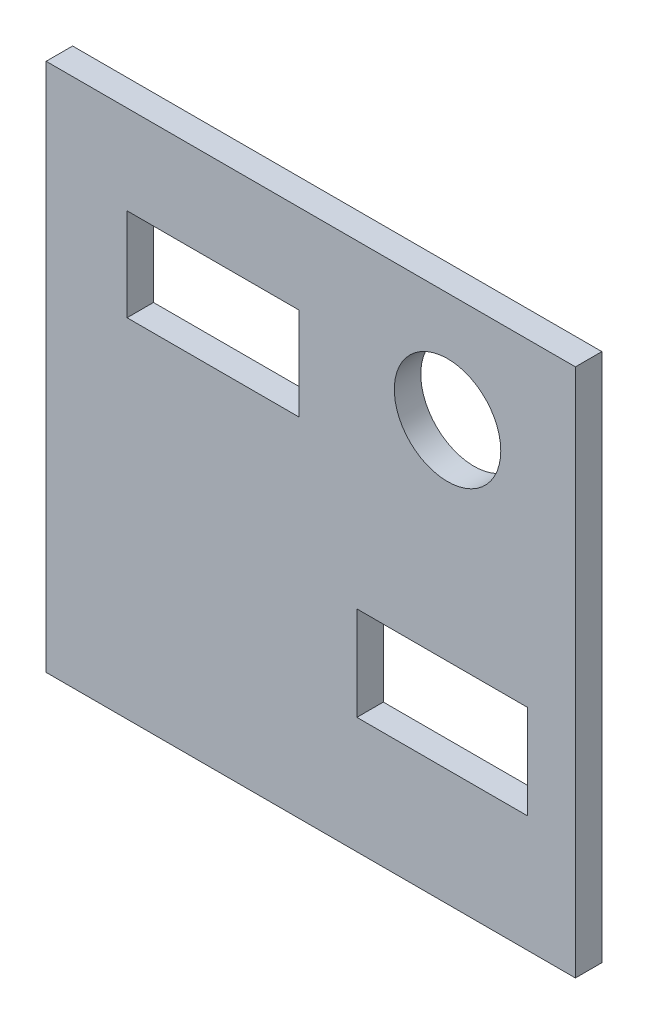
ISO-10303-21;
HEADER;
FILE_DESCRIPTION(('STEP AP214'),'2;1');
FILE_NAME('part.step','',(''),(''),'','','');
FILE_SCHEMA(('AUTOMOTIVE_DESIGN { 1 0 10303 214 1 1 1 1 }'));
ENDSEC;
DATA;
#1=APPLICATION_CONTEXT('core data for automotive mechanical design processes');
#2=APPLICATION_PROTOCOL_DEFINITION('international standard','automotive_design',2000,#1);
#3=PRODUCT_CONTEXT('',#1,'mechanical');
#4=PRODUCT('Part','Part','',(#3));
#5=PRODUCT_RELATED_PRODUCT_CATEGORY('part','',(#4));
#6=PRODUCT_DEFINITION_FORMATION('','',#4);
#7=PRODUCT_DEFINITION_CONTEXT('part definition',#1,'design');
#8=PRODUCT_DEFINITION('design','',#6,#7);
#9=PRODUCT_DEFINITION_SHAPE('','',#8);
#10=(LENGTH_UNIT() NAMED_UNIT(*) SI_UNIT(.MILLI.,.METRE.));
#11=(NAMED_UNIT(*) PLANE_ANGLE_UNIT() SI_UNIT($,.RADIAN.));
#12=(NAMED_UNIT(*) SI_UNIT($,.STERADIAN.) SOLID_ANGLE_UNIT());
#13=UNCERTAINTY_MEASURE_WITH_UNIT(LENGTH_MEASURE(1.E-05),#10,'distance_accuracy_value','');
#14=(GEOMETRIC_REPRESENTATION_CONTEXT(3) GLOBAL_UNCERTAINTY_ASSIGNED_CONTEXT((#13)) GLOBAL_UNIT_ASSIGNED_CONTEXT((#10,
#11,#12)) REPRESENTATION_CONTEXT('',''));
#15=CARTESIAN_POINT('',(0.,0.,0.));
#16=DIRECTION('',(0.,0.,1.));
#17=DIRECTION('',(1.,0.,0.));
#18=AXIS2_PLACEMENT_3D('',#15,#16,#17);
#19=CARTESIAN_POINT('',(0.,0.,2.));
#20=DIRECTION('',(0.,0.,1.));
#21=DIRECTION('',(1.,0.,0.));
#22=AXIS2_PLACEMENT_3D('',#19,#20,#21);
#23=PLANE('',#22);
#24=DIRECTION('',(0.,-1.,0.));
#25=VECTOR('',#24,1.);
#26=CARTESIAN_POINT('',(-17.9816513761468,13.6391437308868,2.));
#27=LINE('',#26,#25);
#28=CARTESIAN_POINT('',(-17.9816513761468,13.6391437308868,2.));
#29=VERTEX_POINT('',#28);
#30=CARTESIAN_POINT('',(-17.9816513761468,-26.3608562691132,2.));
#31=VERTEX_POINT('',#30);
#32=EDGE_CURVE('E195',#29,#31,#27,.T.);
#33=ORIENTED_EDGE('',*,*,#32,.T.);
#34=DIRECTION('',(1.,0.,0.));
#35=VECTOR('',#34,1.);
#36=CARTESIAN_POINT('',(-17.9816513761468,-26.3608562691132,2.));
#37=LINE('',#36,#35);
#38=CARTESIAN_POINT('',(22.0183486238532,-26.3608562691132,2.));
#39=VERTEX_POINT('',#38);
#40=EDGE_CURVE('E198',#31,#39,#37,.T.);
#41=ORIENTED_EDGE('',*,*,#40,.T.);
#42=DIRECTION('',(0.,1.,0.));
#43=VECTOR('',#42,1.);
#44=CARTESIAN_POINT('',(22.0183486238532,13.6391437308868,2.));
#45=LINE('',#44,#43);
#46=CARTESIAN_POINT('',(22.0183486238532,13.6391437308868,2.));
#47=VERTEX_POINT('',#46);
#48=EDGE_CURVE('E201',#39,#47,#45,.T.);
#49=ORIENTED_EDGE('',*,*,#48,.T.);
#50=DIRECTION('',(-1.,0.,0.));
#51=VECTOR('',#50,1.);
#52=CARTESIAN_POINT('',(-17.9816513761468,13.6391437308868,2.));
#53=LINE('',#52,#51);
#54=EDGE_CURVE('E203',#47,#29,#53,.T.);
#55=ORIENTED_EDGE('',*,*,#54,.T.);
#56=EDGE_LOOP('',(#33,#41,#49,#55));
#57=FACE_BOUND('',#56,.T.);
#58=CARTESIAN_POINT('',(12.3547400611621,5.3211009174312,2.));
#59=DIRECTION('',(0.,0.,1.));
#60=DIRECTION('',(1.,0.,0.));
#61=AXIS2_PLACEMENT_3D('',#58,#59,#60);
#62=CIRCLE('',#61,4.02370255740637);
#63=CARTESIAN_POINT('',(16.3784426185684,5.3211009174312,2.));
#64=VERTEX_POINT('',#63);
#65=EDGE_CURVE('E189',#64,#64,#62,.T.);
#66=ORIENTED_EDGE('',*,*,#65,.F.);
#67=EDGE_LOOP('',(#66));
#68=FACE_BOUND('',#67,.T.);
#69=DIRECTION('',(1.,0.,0.));
#70=VECTOR('',#69,1.);
#71=CARTESIAN_POINT('',(-11.8654434250764,-0.0886850152905178,2.));
#72=LINE('',#71,#70);
#73=CARTESIAN_POINT('',(-11.8654434250764,-0.0886850152905178,2.));
#74=VERTEX_POINT('',#73);
#75=CARTESIAN_POINT('',(1.13455657492355,-0.0886850152905178,2.));
#76=VERTEX_POINT('',#75);
#77=EDGE_CURVE('E160',#74,#76,#72,.T.);
#78=ORIENTED_EDGE('',*,*,#77,.F.);
#79=DIRECTION('',(0.,-1.,0.));
#80=VECTOR('',#79,1.);
#81=CARTESIAN_POINT('',(-11.8654434250764,6.91131498470948,2.));
#82=LINE('',#81,#80);
#83=CARTESIAN_POINT('',(-11.8654434250764,6.91131498470948,2.));
#84=VERTEX_POINT('',#83);
#85=EDGE_CURVE('E158',#84,#74,#82,.T.);
#86=ORIENTED_EDGE('',*,*,#85,.F.);
#87=DIRECTION('',(-1.,0.,0.));
#88=VECTOR('',#87,1.);
#89=CARTESIAN_POINT('',(-11.8654434250764,6.91131498470948,2.));
#90=LINE('',#89,#88);
#91=CARTESIAN_POINT('',(1.13455657492355,6.91131498470948,2.));
#92=VERTEX_POINT('',#91);
#93=EDGE_CURVE('E166',#92,#84,#90,.T.);
#94=ORIENTED_EDGE('',*,*,#93,.F.);
#95=DIRECTION('',(0.,1.,0.));
#96=VECTOR('',#95,1.);
#97=CARTESIAN_POINT('',(1.13455657492355,6.91131498470948,2.));
#98=LINE('',#97,#96);
#99=EDGE_CURVE('E163',#76,#92,#98,.T.);
#100=ORIENTED_EDGE('',*,*,#99,.F.);
#101=EDGE_LOOP('',(#78,#86,#94,#100));
#102=FACE_BOUND('',#101,.T.);
#103=DIRECTION('',(1.,0.,0.));
#104=VECTOR('',#103,1.);
#105=CARTESIAN_POINT('',(5.5045871559633,-17.5587155963303,2.));
#106=LINE('',#105,#104);
#107=CARTESIAN_POINT('',(5.5045871559633,-17.5587155963303,2.));
#108=VERTEX_POINT('',#107);
#109=CARTESIAN_POINT('',(18.4045871559633,-17.5587155963303,2.));
#110=VERTEX_POINT('',#109);
#111=EDGE_CURVE('E130',#108,#110,#106,.T.);
#112=ORIENTED_EDGE('',*,*,#111,.F.);
#113=DIRECTION('',(0.,-1.,0.));
#114=VECTOR('',#113,1.);
#115=CARTESIAN_POINT('',(5.5045871559633,-10.4587155963303,2.));
#116=LINE('',#115,#114);
#117=CARTESIAN_POINT('',(5.5045871559633,-10.4587155963303,2.));
#118=VERTEX_POINT('',#117);
#119=EDGE_CURVE('E122',#118,#108,#116,.T.);
#120=ORIENTED_EDGE('',*,*,#119,.F.);
#121=DIRECTION('',(-1.,0.,0.));
#122=VECTOR('',#121,1.);
#123=CARTESIAN_POINT('',(5.5045871559633,-10.4587155963303,2.));
#124=LINE('',#123,#122);
#125=CARTESIAN_POINT('',(18.4045871559633,-10.4587155963303,2.));
#126=VERTEX_POINT('',#125);
#127=EDGE_CURVE('E144',#126,#118,#124,.T.);
#128=ORIENTED_EDGE('',*,*,#127,.F.);
#129=DIRECTION('',(0.,1.,0.));
#130=VECTOR('',#129,1.);
#131=CARTESIAN_POINT('',(18.4045871559633,-10.4587155963303,2.));
#132=LINE('',#131,#130);
#133=EDGE_CURVE('E142',#110,#126,#132,.T.);
#134=ORIENTED_EDGE('',*,*,#133,.F.);
#135=EDGE_LOOP('',(#112,#120,#128,#134));
#136=FACE_BOUND('',#135,.T.);
#137=ADVANCED_FACE('F33',(#57,#68,#102,#136),#23,.T.);
#138=CARTESIAN_POINT('',(0.,0.,0.));
#139=DIRECTION('',(0.,0.,1.));
#140=DIRECTION('',(1.,0.,0.));
#141=AXIS2_PLACEMENT_3D('',#138,#139,#140);
#142=PLANE('',#141);
#143=DIRECTION('',(0.,-1.,0.));
#144=VECTOR('',#143,1.);
#145=CARTESIAN_POINT('',(-11.8654434250764,6.91131498470948,0.));
#146=LINE('',#145,#144);
#147=CARTESIAN_POINT('',(-11.8654434250764,6.91131498470948,0.));
#148=VERTEX_POINT('',#147);
#149=CARTESIAN_POINT('',(-11.8654434250764,-0.0886850152905178,0.));
#150=VERTEX_POINT('',#149);
#151=EDGE_CURVE('E138',#148,#150,#146,.T.);
#152=ORIENTED_EDGE('',*,*,#151,.T.);
#153=DIRECTION('',(1.,0.,0.));
#154=VECTOR('',#153,1.);
#155=CARTESIAN_POINT('',(-11.8654434250764,-0.0886850152905178,0.));
#156=LINE('',#155,#154);
#157=CARTESIAN_POINT('',(1.13455657492355,-0.0886850152905178,0.));
#158=VERTEX_POINT('',#157);
#159=EDGE_CURVE('E171',#150,#158,#156,.T.);
#160=ORIENTED_EDGE('',*,*,#159,.T.);
#161=DIRECTION('',(0.,1.,0.));
#162=VECTOR('',#161,1.);
#163=CARTESIAN_POINT('',(1.13455657492355,6.91131498470948,0.));
#164=LINE('',#163,#162);
#165=CARTESIAN_POINT('',(1.13455657492355,6.91131498470948,0.));
#166=VERTEX_POINT('',#165);
#167=EDGE_CURVE('E174',#158,#166,#164,.T.);
#168=ORIENTED_EDGE('',*,*,#167,.T.);
#169=DIRECTION('',(-1.,0.,0.));
#170=VECTOR('',#169,1.);
#171=CARTESIAN_POINT('',(-11.8654434250764,6.91131498470948,0.));
#172=LINE('',#171,#170);
#173=EDGE_CURVE('E161',#166,#148,#172,.T.);
#174=ORIENTED_EDGE('',*,*,#173,.T.);
#175=EDGE_LOOP('',(#152,#160,#168,#174));
#176=FACE_BOUND('',#175,.T.);
#177=DIRECTION('',(0.,-1.,0.));
#178=VECTOR('',#177,1.);
#179=CARTESIAN_POINT('',(-17.9816513761468,13.6391437308868,0.));
#180=LINE('',#179,#178);
#181=CARTESIAN_POINT('',(-17.9816513761468,13.6391437308868,0.));
#182=VERTEX_POINT('',#181);
#183=CARTESIAN_POINT('',(-17.9816513761468,-26.3608562691132,0.));
#184=VERTEX_POINT('',#183);
#185=EDGE_CURVE('E192',#182,#184,#180,.T.);
#186=ORIENTED_EDGE('',*,*,#185,.F.);
#187=DIRECTION('',(-1.,0.,0.));
#188=VECTOR('',#187,1.);
#189=CARTESIAN_POINT('',(-17.9816513761468,13.6391437308868,0.));
#190=LINE('',#189,#188);
#191=CARTESIAN_POINT('',(22.0183486238532,13.6391437308868,0.));
#192=VERTEX_POINT('',#191);
#193=EDGE_CURVE('E199',#192,#182,#190,.T.);
#194=ORIENTED_EDGE('',*,*,#193,.F.);
#195=DIRECTION('',(0.,1.,0.));
#196=VECTOR('',#195,1.);
#197=CARTESIAN_POINT('',(22.0183486238532,13.6391437308868,0.));
#198=LINE('',#197,#196);
#199=CARTESIAN_POINT('',(22.0183486238532,-26.3608562691132,0.));
#200=VERTEX_POINT('',#199);
#201=EDGE_CURVE('E210',#200,#192,#198,.T.);
#202=ORIENTED_EDGE('',*,*,#201,.F.);
#203=DIRECTION('',(1.,0.,0.));
#204=VECTOR('',#203,1.);
#205=CARTESIAN_POINT('',(-17.9816513761468,-26.3608562691132,0.));
#206=LINE('',#205,#204);
#207=EDGE_CURVE('E208',#184,#200,#206,.T.);
#208=ORIENTED_EDGE('',*,*,#207,.F.);
#209=EDGE_LOOP('',(#186,#194,#202,#208));
#210=FACE_BOUND('',#209,.T.);
#211=CARTESIAN_POINT('',(12.3547400611621,5.3211009174312,0.));
#212=DIRECTION('',(0.,0.,1.));
#213=DIRECTION('',(1.,0.,0.));
#214=AXIS2_PLACEMENT_3D('',#211,#212,#213);
#215=CIRCLE('',#214,4.02370255740637);
#216=CARTESIAN_POINT('',(16.3784426185684,5.3211009174312,0.));
#217=VERTEX_POINT('',#216);
#218=EDGE_CURVE('E188',#217,#217,#215,.T.);
#219=ORIENTED_EDGE('',*,*,#218,.T.);
#220=EDGE_LOOP('',(#219));
#221=FACE_BOUND('',#220,.T.);
#222=DIRECTION('',(0.,-1.,0.));
#223=VECTOR('',#222,1.);
#224=CARTESIAN_POINT('',(5.5045871559633,-10.4587155963303,0.));
#225=LINE('',#224,#223);
#226=CARTESIAN_POINT('',(5.5045871559633,-10.4587155963303,0.));
#227=VERTEX_POINT('',#226);
#228=CARTESIAN_POINT('',(5.5045871559633,-17.5587155963303,0.));
#229=VERTEX_POINT('',#228);
#230=EDGE_CURVE('E56',#227,#229,#225,.T.);
#231=ORIENTED_EDGE('',*,*,#230,.T.);
#232=DIRECTION('',(1.,0.,0.));
#233=VECTOR('',#232,1.);
#234=CARTESIAN_POINT('',(5.5045871559633,-17.5587155963303,0.));
#235=LINE('',#234,#233);
#236=CARTESIAN_POINT('',(18.4045871559633,-17.5587155963303,0.));
#237=VERTEX_POINT('',#236);
#238=EDGE_CURVE('E137',#229,#237,#235,.T.);
#239=ORIENTED_EDGE('',*,*,#238,.T.);
#240=DIRECTION('',(0.,1.,0.));
#241=VECTOR('',#240,1.);
#242=CARTESIAN_POINT('',(18.4045871559633,-10.4587155963303,0.));
#243=LINE('',#242,#241);
#244=CARTESIAN_POINT('',(18.4045871559633,-10.4587155963303,0.));
#245=VERTEX_POINT('',#244);
#246=EDGE_CURVE('E150',#237,#245,#243,.T.);
#247=ORIENTED_EDGE('',*,*,#246,.T.);
#248=DIRECTION('',(-1.,0.,0.));
#249=VECTOR('',#248,1.);
#250=CARTESIAN_POINT('',(5.5045871559633,-10.4587155963303,0.));
#251=LINE('',#250,#249);
#252=EDGE_CURVE('E131',#245,#227,#251,.T.);
#253=ORIENTED_EDGE('',*,*,#252,.T.);
#254=EDGE_LOOP('',(#231,#239,#247,#253));
#255=FACE_BOUND('',#254,.T.);
#256=ADVANCED_FACE('F228',(#176,#210,#221,#255),#142,.F.);
#257=CARTESIAN_POINT('',(-17.9816513761468,13.6391437308868,2.));
#258=DIRECTION('',(1.,0.,0.));
#259=DIRECTION('',(0.,1.,0.));
#260=AXIS2_PLACEMENT_3D('',#257,#258,#259);
#261=PLANE('',#260);
#262=ORIENTED_EDGE('',*,*,#185,.T.);
#263=DIRECTION('',(0.,0.,-1.));
#264=VECTOR('',#263,1.);
#265=CARTESIAN_POINT('',(-17.9816513761468,-26.3608562691132,2.));
#266=LINE('',#265,#264);
#267=EDGE_CURVE('E11',#31,#184,#266,.T.);
#268=ORIENTED_EDGE('',*,*,#267,.F.);
#269=ORIENTED_EDGE('',*,*,#32,.F.);
#270=DIRECTION('',(0.,0.,-1.));
#271=VECTOR('',#270,1.);
#272=CARTESIAN_POINT('',(-17.9816513761468,13.6391437308868,2.));
#273=LINE('',#272,#271);
#274=EDGE_CURVE('E205',#29,#182,#273,.T.);
#275=ORIENTED_EDGE('',*,*,#274,.T.);
#276=EDGE_LOOP('',(#262,#268,#269,#275));
#277=FACE_BOUND('',#276,.T.);
#278=ADVANCED_FACE('F35',(#277),#261,.F.);
#279=CARTESIAN_POINT('',(-17.9816513761468,-26.3608562691132,2.));
#280=DIRECTION('',(0.,1.,0.));
#281=DIRECTION('',(0.,0.,1.));
#282=AXIS2_PLACEMENT_3D('',#279,#280,#281);
#283=PLANE('',#282);
#284=ORIENTED_EDGE('',*,*,#207,.T.);
#285=DIRECTION('',(0.,0.,-1.));
#286=VECTOR('',#285,1.);
#287=CARTESIAN_POINT('',(22.0183486238532,-26.3608562691132,2.));
#288=LINE('',#287,#286);
#289=EDGE_CURVE('E41',#39,#200,#288,.T.);
#290=ORIENTED_EDGE('',*,*,#289,.F.);
#291=ORIENTED_EDGE('',*,*,#40,.F.);
#292=ORIENTED_EDGE('',*,*,#267,.T.);
#293=EDGE_LOOP('',(#284,#290,#291,#292));
#294=FACE_BOUND('',#293,.T.);
#295=ADVANCED_FACE('F239',(#294),#283,.F.);
#296=CARTESIAN_POINT('',(22.0183486238532,13.6391437308868,2.));
#297=DIRECTION('',(-1.,0.,0.));
#298=DIRECTION('',(0.,0.,1.));
#299=AXIS2_PLACEMENT_3D('',#296,#297,#298);
#300=PLANE('',#299);
#301=ORIENTED_EDGE('',*,*,#201,.T.);
#302=DIRECTION('',(0.,0.,-1.));
#303=VECTOR('',#302,1.);
#304=CARTESIAN_POINT('',(22.0183486238532,13.6391437308868,2.));
#305=LINE('',#304,#303);
#306=EDGE_CURVE('E215',#47,#192,#305,.T.);
#307=ORIENTED_EDGE('',*,*,#306,.F.);
#308=ORIENTED_EDGE('',*,*,#48,.F.);
#309=ORIENTED_EDGE('',*,*,#289,.T.);
#310=EDGE_LOOP('',(#301,#307,#308,#309));
#311=FACE_BOUND('',#310,.T.);
#312=ADVANCED_FACE('F222',(#311),#300,.F.);
#313=CARTESIAN_POINT('',(-17.9816513761468,13.6391437308868,2.));
#314=DIRECTION('',(0.,-1.,0.));
#315=DIRECTION('',(0.,0.,-1.));
#316=AXIS2_PLACEMENT_3D('',#313,#314,#315);
#317=PLANE('',#316);
#318=ORIENTED_EDGE('',*,*,#193,.T.);
#319=ORIENTED_EDGE('',*,*,#274,.F.);
#320=ORIENTED_EDGE('',*,*,#54,.F.);
#321=ORIENTED_EDGE('',*,*,#306,.T.);
#322=EDGE_LOOP('',(#318,#319,#320,#321));
#323=FACE_BOUND('',#322,.T.);
#324=ADVANCED_FACE('F232',(#323),#317,.F.);
#325=CARTESIAN_POINT('',(12.3547400611621,5.3211009174312,2.));
#326=DIRECTION('',(0.,0.,-1.));
#327=DIRECTION('',(-1.,0.,0.));
#328=AXIS2_PLACEMENT_3D('',#325,#326,#327);
#329=CYLINDRICAL_SURFACE('',#328,4.02370255740637);
#330=ORIENTED_EDGE('',*,*,#65,.T.);
#331=EDGE_LOOP('',(#330));
#332=FACE_BOUND('',#331,.T.);
#333=ORIENTED_EDGE('',*,*,#218,.F.);
#334=EDGE_LOOP('',(#333));
#335=FACE_BOUND('',#334,.T.);
#336=ADVANCED_FACE('F254',(#332,#335),#329,.F.);
#337=CARTESIAN_POINT('',(-11.8654434250764,6.91131498470948,2.));
#338=DIRECTION('',(1.,0.,0.));
#339=DIRECTION('',(0.,0.,-1.));
#340=AXIS2_PLACEMENT_3D('',#337,#338,#339);
#341=PLANE('',#340);
#342=ORIENTED_EDGE('',*,*,#151,.F.);
#343=DIRECTION('',(0.,0.,-1.));
#344=VECTOR('',#343,1.);
#345=CARTESIAN_POINT('',(-11.8654434250764,6.91131498470948,2.));
#346=LINE('',#345,#344);
#347=EDGE_CURVE('E168',#84,#148,#346,.T.);
#348=ORIENTED_EDGE('',*,*,#347,.F.);
#349=ORIENTED_EDGE('',*,*,#85,.T.);
#350=DIRECTION('',(0.,0.,-1.));
#351=VECTOR('',#350,1.);
#352=CARTESIAN_POINT('',(-11.8654434250764,-0.0886850152905178,2.));
#353=LINE('',#352,#351);
#354=EDGE_CURVE('E185',#74,#150,#353,.T.);
#355=ORIENTED_EDGE('',*,*,#354,.T.);
#356=EDGE_LOOP('',(#342,#348,#349,#355));
#357=FACE_BOUND('',#356,.T.);
#358=ADVANCED_FACE('F261',(#357),#341,.T.);
#359=CARTESIAN_POINT('',(-11.8654434250764,-0.0886850152905178,2.));
#360=DIRECTION('',(0.,1.,0.));
#361=DIRECTION('',(0.,0.,1.));
#362=AXIS2_PLACEMENT_3D('',#359,#360,#361);
#363=PLANE('',#362);
#364=ORIENTED_EDGE('',*,*,#159,.F.);
#365=ORIENTED_EDGE('',*,*,#354,.F.);
#366=ORIENTED_EDGE('',*,*,#77,.T.);
#367=DIRECTION('',(0.,0.,-1.));
#368=VECTOR('',#367,1.);
#369=CARTESIAN_POINT('',(1.13455657492355,-0.0886850152905178,2.));
#370=LINE('',#369,#368);
#371=EDGE_CURVE('E183',#76,#158,#370,.T.);
#372=ORIENTED_EDGE('',*,*,#371,.T.);
#373=EDGE_LOOP('',(#364,#365,#366,#372));
#374=FACE_BOUND('',#373,.T.);
#375=ADVANCED_FACE('F266',(#374),#363,.T.);
#376=CARTESIAN_POINT('',(1.13455657492355,6.91131498470948,2.));
#377=DIRECTION('',(-1.,0.,0.));
#378=DIRECTION('',(0.,-1.,0.));
#379=AXIS2_PLACEMENT_3D('',#376,#377,#378);
#380=PLANE('',#379);
#381=ORIENTED_EDGE('',*,*,#167,.F.);
#382=ORIENTED_EDGE('',*,*,#371,.F.);
#383=ORIENTED_EDGE('',*,*,#99,.T.);
#384=DIRECTION('',(0.,0.,-1.));
#385=VECTOR('',#384,1.);
#386=CARTESIAN_POINT('',(1.13455657492355,6.91131498470948,2.));
#387=LINE('',#386,#385);
#388=EDGE_CURVE('E181',#92,#166,#387,.T.);
#389=ORIENTED_EDGE('',*,*,#388,.T.);
#390=EDGE_LOOP('',(#381,#382,#383,#389));
#391=FACE_BOUND('',#390,.T.);
#392=ADVANCED_FACE('F290',(#391),#380,.T.);
#393=CARTESIAN_POINT('',(-11.8654434250764,6.91131498470948,2.));
#394=DIRECTION('',(0.,-1.,0.));
#395=DIRECTION('',(0.,0.,-1.));
#396=AXIS2_PLACEMENT_3D('',#393,#394,#395);
#397=PLANE('',#396);
#398=ORIENTED_EDGE('',*,*,#173,.F.);
#399=ORIENTED_EDGE('',*,*,#388,.F.);
#400=ORIENTED_EDGE('',*,*,#93,.T.);
#401=ORIENTED_EDGE('',*,*,#347,.T.);
#402=EDGE_LOOP('',(#398,#399,#400,#401));
#403=FACE_BOUND('',#402,.T.);
#404=ADVANCED_FACE('F287',(#403),#397,.T.);
#405=CARTESIAN_POINT('',(5.5045871559633,-10.4587155963303,2.));
#406=DIRECTION('',(1.,0.,0.));
#407=DIRECTION('',(0.,1.,0.));
#408=AXIS2_PLACEMENT_3D('',#405,#406,#407);
#409=PLANE('',#408);
#410=ORIENTED_EDGE('',*,*,#230,.F.);
#411=DIRECTION('',(0.,0.,-1.));
#412=VECTOR('',#411,1.);
#413=CARTESIAN_POINT('',(5.5045871559633,-10.4587155963303,2.));
#414=LINE('',#413,#412);
#415=EDGE_CURVE('E126',#118,#227,#414,.T.);
#416=ORIENTED_EDGE('',*,*,#415,.F.);
#417=ORIENTED_EDGE('',*,*,#119,.T.);
#418=DIRECTION('',(0.,0.,-1.));
#419=VECTOR('',#418,1.);
#420=CARTESIAN_POINT('',(5.5045871559633,-17.5587155963303,2.));
#421=LINE('',#420,#419);
#422=EDGE_CURVE('E125',#108,#229,#421,.T.);
#423=ORIENTED_EDGE('',*,*,#422,.T.);
#424=EDGE_LOOP('',(#410,#416,#417,#423));
#425=FACE_BOUND('',#424,.T.);
#426=ADVANCED_FACE('F124',(#425),#409,.T.);
#427=CARTESIAN_POINT('',(5.5045871559633,-17.5587155963303,2.));
#428=DIRECTION('',(0.,1.,0.));
#429=DIRECTION('',(0.,0.,1.));
#430=AXIS2_PLACEMENT_3D('',#427,#428,#429);
#431=PLANE('',#430);
#432=ORIENTED_EDGE('',*,*,#238,.F.);
#433=ORIENTED_EDGE('',*,*,#422,.F.);
#434=ORIENTED_EDGE('',*,*,#111,.T.);
#435=DIRECTION('',(0.,0.,-1.));
#436=VECTOR('',#435,1.);
#437=CARTESIAN_POINT('',(18.4045871559633,-17.5587155963303,2.));
#438=LINE('',#437,#436);
#439=EDGE_CURVE('E139',#110,#237,#438,.T.);
#440=ORIENTED_EDGE('',*,*,#439,.T.);
#441=EDGE_LOOP('',(#432,#433,#434,#440));
#442=FACE_BOUND('',#441,.T.);
#443=ADVANCED_FACE('F134',(#442),#431,.T.);
#444=CARTESIAN_POINT('',(18.4045871559633,-10.4587155963303,2.));
#445=DIRECTION('',(-1.,0.,0.));
#446=DIRECTION('',(0.,-1.,0.));
#447=AXIS2_PLACEMENT_3D('',#444,#445,#446);
#448=PLANE('',#447);
#449=ORIENTED_EDGE('',*,*,#246,.F.);
#450=ORIENTED_EDGE('',*,*,#439,.F.);
#451=ORIENTED_EDGE('',*,*,#133,.T.);
#452=DIRECTION('',(0.,0.,-1.));
#453=VECTOR('',#452,1.);
#454=CARTESIAN_POINT('',(18.4045871559633,-10.4587155963303,2.));
#455=LINE('',#454,#453);
#456=EDGE_CURVE('E48',#126,#245,#455,.T.);
#457=ORIENTED_EDGE('',*,*,#456,.T.);
#458=EDGE_LOOP('',(#449,#450,#451,#457));
#459=FACE_BOUND('',#458,.T.);
#460=ADVANCED_FACE('F275',(#459),#448,.T.);
#461=CARTESIAN_POINT('',(5.5045871559633,-10.4587155963303,2.));
#462=DIRECTION('',(0.,-1.,0.));
#463=DIRECTION('',(0.,0.,-1.));
#464=AXIS2_PLACEMENT_3D('',#461,#462,#463);
#465=PLANE('',#464);
#466=ORIENTED_EDGE('',*,*,#252,.F.);
#467=ORIENTED_EDGE('',*,*,#456,.F.);
#468=ORIENTED_EDGE('',*,*,#127,.T.);
#469=ORIENTED_EDGE('',*,*,#415,.T.);
#470=EDGE_LOOP('',(#466,#467,#468,#469));
#471=FACE_BOUND('',#470,.T.);
#472=ADVANCED_FACE('F273',(#471),#465,.T.);
#473=CLOSED_SHELL('',(#137,#256,#278,#295,#312,#324,#336,#358,#375,#392,#404,#426,#443,#460,#472));
#474=MANIFOLD_SOLID_BREP('B2',#473);
#475=ADVANCED_BREP_SHAPE_REPRESENTATION('',(#18,#474),#14);
#476=SHAPE_DEFINITION_REPRESENTATION(#9,#475);
ENDSEC;
END-ISO-10303-21;
